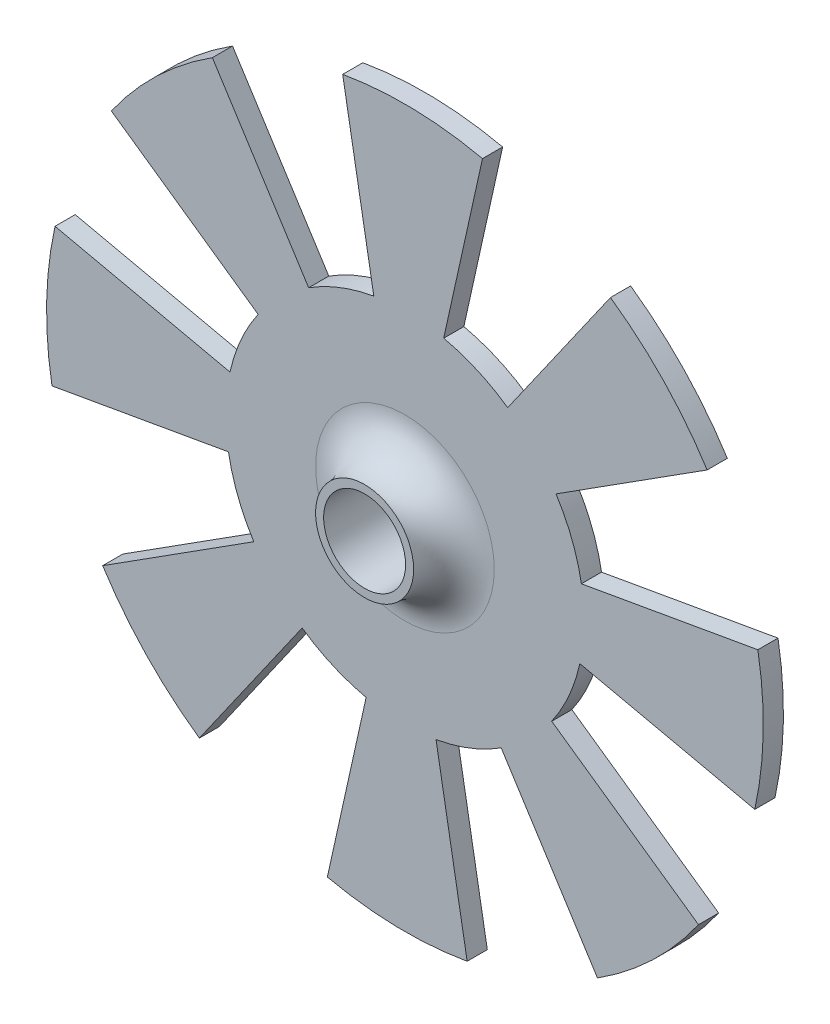
ISO-10303-21;
HEADER;
FILE_DESCRIPTION(('STEP AP214'),'2;1');
FILE_NAME('part.step','',(''),(''),'','','');
FILE_SCHEMA(('AUTOMOTIVE_DESIGN { 1 0 10303 214 1 1 1 1 }'));
ENDSEC;
DATA;
#1=APPLICATION_CONTEXT('core data for automotive mechanical design processes');
#2=APPLICATION_PROTOCOL_DEFINITION('international standard','automotive_design',2000,#1);
#3=PRODUCT_CONTEXT('',#1,'mechanical');
#4=PRODUCT('Part','Part','',(#3));
#5=PRODUCT_RELATED_PRODUCT_CATEGORY('part','',(#4));
#6=PRODUCT_DEFINITION_FORMATION('','',#4);
#7=PRODUCT_DEFINITION_CONTEXT('part definition',#1,'design');
#8=PRODUCT_DEFINITION('design','',#6,#7);
#9=PRODUCT_DEFINITION_SHAPE('','',#8);
#10=(LENGTH_UNIT() NAMED_UNIT(*) SI_UNIT(.MILLI.,.METRE.));
#11=(NAMED_UNIT(*) PLANE_ANGLE_UNIT() SI_UNIT($,.RADIAN.));
#12=(NAMED_UNIT(*) SI_UNIT($,.STERADIAN.) SOLID_ANGLE_UNIT());
#13=UNCERTAINTY_MEASURE_WITH_UNIT(LENGTH_MEASURE(1.E-05),#10,'distance_accuracy_value','');
#14=(GEOMETRIC_REPRESENTATION_CONTEXT(3) GLOBAL_UNCERTAINTY_ASSIGNED_CONTEXT((#13)) GLOBAL_UNIT_ASSIGNED_CONTEXT((#10,
#11,#12)) REPRESENTATION_CONTEXT('',''));
#15=CARTESIAN_POINT('',(0.,0.,0.));
#16=DIRECTION('',(0.,0.,1.));
#17=DIRECTION('',(1.,0.,0.));
#18=AXIS2_PLACEMENT_3D('',#15,#16,#17);
#19=CARTESIAN_POINT('',(0.,0.,0.));
#20=DIRECTION('',(0.,0.,1.));
#21=DIRECTION('',(1.,0.,0.));
#22=AXIS2_PLACEMENT_3D('',#19,#20,#21);
#23=PLANE('',#22);
#24=CARTESIAN_POINT('',(0.,0.,0.));
#25=DIRECTION('',(0.,0.,1.));
#26=DIRECTION('',(1.,0.,0.));
#27=AXIS2_PLACEMENT_3D('',#24,#25,#26);
#28=CIRCLE('',#27,2.216);
#29=CARTESIAN_POINT('',(2.216,0.,0.));
#30=VERTEX_POINT('',#29);
#31=EDGE_CURVE('E12',#30,#30,#28,.F.);
#32=ORIENTED_EDGE('',*,*,#31,.T.);
#33=EDGE_LOOP('',(#32));
#34=FACE_BOUND('',#33,.T.);
#35=CARTESIAN_POINT('',(0.,0.,0.));
#36=DIRECTION('',(0.,0.,1.));
#37=DIRECTION('',(1.,0.,0.));
#38=AXIS2_PLACEMENT_3D('',#35,#36,#37);
#39=CIRCLE('',#38,4.445);
#40=CARTESIAN_POINT('',(0.771866149729554,-4.37747046213926,0.));
#41=VERTEX_POINT('',#40);
#42=CARTESIAN_POINT('',(2.38829675910162,-3.74887497663828,0.));
#43=VERTEX_POINT('',#42);
#44=EDGE_CURVE('E146',#41,#43,#39,.T.);
#45=ORIENTED_EDGE('',*,*,#44,.T.);
#46=DIRECTION('',(0.537299608346821,-0.843391445812887,0.));
#47=VECTOR('',#46,1.);
#48=CARTESIAN_POINT('',(0.,0.,0.));
#49=LINE('',#48,#47);
#50=CARTESIAN_POINT('',(4.77659351820324,-7.49774995327657,0.));
#51=VERTEX_POINT('',#50);
#52=EDGE_CURVE('E413',#43,#51,#49,.T.);
#53=ORIENTED_EDGE('',*,*,#52,.T.);
#54=CARTESIAN_POINT('',(0.,0.,0.));
#55=DIRECTION('',(0.,0.,1.));
#56=DIRECTION('',(1.,0.,0.));
#57=AXIS2_PLACEMENT_3D('',#54,#55,#56);
#58=CIRCLE('',#57,8.89);
#59=CARTESIAN_POINT('',(7.28226167372914,-5.09909451916079,0.));
#60=VERTEX_POINT('',#59);
#61=EDGE_CURVE('E583',#51,#60,#58,.T.);
#62=ORIENTED_EDGE('',*,*,#61,.T.);
#63=DIRECTION('',(0.819152044288993,-0.573576436351044,0.));
#64=VECTOR('',#63,1.);
#65=CARTESIAN_POINT('',(0.,0.,0.));
#66=LINE('',#65,#64);
#67=CARTESIAN_POINT('',(3.64113083686457,-2.5495472595804,0.));
#68=VERTEX_POINT('',#67);
#69=EDGE_CURVE('E494',#68,#60,#66,.T.);
#70=ORIENTED_EDGE('',*,*,#69,.F.);
#71=CARTESIAN_POINT('',(0.,0.,0.));
#72=DIRECTION('',(0.,0.,1.));
#73=DIRECTION('',(1.,0.,0.));
#74=AXIS2_PLACEMENT_3D('',#71,#72,#73);
#75=CIRCLE('',#74,4.445);
#76=CARTESIAN_POINT('',(4.3396357516481,-0.962074083954887,0.));
#77=VERTEX_POINT('',#76);
#78=EDGE_CURVE('E427',#68,#77,#75,.T.);
#79=ORIENTED_EDGE('',*,*,#78,.T.);
#80=DIRECTION('',(0.976296007119932,-0.216439613938107,0.));
#81=VECTOR('',#80,1.);
#82=CARTESIAN_POINT('',(0.,0.,0.));
#83=LINE('',#82,#81);
#84=CARTESIAN_POINT('',(8.6792715032962,-1.92414816790977,0.));
#85=VERTEX_POINT('',#84);
#86=EDGE_CURVE('E486',#77,#85,#83,.T.);
#87=ORIENTED_EDGE('',*,*,#86,.T.);
#88=CARTESIAN_POINT('',(8.75494092427854,1.54373229945897,0.));
#89=VERTEX_POINT('',#88);
#90=EDGE_CURVE('E579',#85,#89,#58,.T.);
#91=ORIENTED_EDGE('',*,*,#90,.T.);
#92=DIRECTION('',(0.984807753012208,0.173648177666931,0.));
#93=VECTOR('',#92,1.);
#94=CARTESIAN_POINT('',(0.,0.,0.));
#95=LINE('',#94,#93);
#96=CARTESIAN_POINT('',(4.37747046213927,0.771866149729464,0.));
#97=VERTEX_POINT('',#96);
#98=EDGE_CURVE('E467',#97,#89,#95,.T.);
#99=ORIENTED_EDGE('',*,*,#98,.F.);
#100=CARTESIAN_POINT('',(0.,0.,0.));
#101=DIRECTION('',(0.,0.,1.));
#102=DIRECTION('',(1.,0.,0.));
#103=AXIS2_PLACEMENT_3D('',#100,#101,#102);
#104=CIRCLE('',#103,4.445);
#105=CARTESIAN_POINT('',(3.74887497663828,2.38829675910162,0.));
#106=VERTEX_POINT('',#105);
#107=EDGE_CURVE('E464',#97,#106,#104,.T.);
#108=ORIENTED_EDGE('',*,*,#107,.T.);
#109=DIRECTION('',(0.843391445812887,0.537299608346822,0.));
#110=VECTOR('',#109,1.);
#111=CARTESIAN_POINT('',(0.,0.,0.));
#112=LINE('',#111,#110);
#113=CARTESIAN_POINT('',(7.49774995327657,4.77659351820324,0.));
#114=VERTEX_POINT('',#113);
#115=EDGE_CURVE('E458',#106,#114,#112,.T.);
#116=ORIENTED_EDGE('',*,*,#115,.T.);
#117=CARTESIAN_POINT('',(5.0990945191608,7.28226167372914,0.));
#118=VERTEX_POINT('',#117);
#119=EDGE_CURVE('E575',#114,#118,#58,.T.);
#120=ORIENTED_EDGE('',*,*,#119,.T.);
#121=DIRECTION('',(0.573576436351044,0.819152044288993,0.));
#122=VECTOR('',#121,1.);
#123=CARTESIAN_POINT('',(0.,0.,0.));
#124=LINE('',#123,#122);
#125=CARTESIAN_POINT('',(2.54954725958041,3.64113083686456,0.));
#126=VERTEX_POINT('',#125);
#127=EDGE_CURVE('E518',#126,#118,#124,.T.);
#128=ORIENTED_EDGE('',*,*,#127,.F.);
#129=CARTESIAN_POINT('',(0.,0.,0.));
#130=DIRECTION('',(0.,0.,1.));
#131=DIRECTION('',(1.,0.,0.));
#132=AXIS2_PLACEMENT_3D('',#129,#130,#131);
#133=CIRCLE('',#132,4.445);
#134=CARTESIAN_POINT('',(0.962074083954882,4.3396357516481,0.));
#135=VERTEX_POINT('',#134);
#136=EDGE_CURVE('E475',#126,#135,#133,.T.);
#137=ORIENTED_EDGE('',*,*,#136,.T.);
#138=DIRECTION('',(0.216439613938106,0.976296007119933,0.));
#139=VECTOR('',#138,1.);
#140=CARTESIAN_POINT('',(0.,0.,0.));
#141=LINE('',#140,#139);
#142=CARTESIAN_POINT('',(1.92414816790976,8.6792715032962,0.));
#143=VERTEX_POINT('',#142);
#144=EDGE_CURVE('E510',#135,#143,#141,.T.);
#145=ORIENTED_EDGE('',*,*,#144,.T.);
#146=CARTESIAN_POINT('',(-1.54373229945906,8.75494092427852,0.));
#147=VERTEX_POINT('',#146);
#148=EDGE_CURVE('E562',#143,#147,#58,.T.);
#149=ORIENTED_EDGE('',*,*,#148,.T.);
#150=DIRECTION('',(-0.173648177666931,0.984807753012208,0.));
#151=VECTOR('',#150,1.);
#152=CARTESIAN_POINT('',(0.,0.,0.));
#153=LINE('',#152,#151);
#154=CARTESIAN_POINT('',(-0.771866149729548,4.37747046213926,0.));
#155=VERTEX_POINT('',#154);
#156=EDGE_CURVE('E544',#155,#147,#153,.T.);
#157=ORIENTED_EDGE('',*,*,#156,.F.);
#158=CARTESIAN_POINT('',(0.,0.,0.));
#159=DIRECTION('',(0.,0.,1.));
#160=DIRECTION('',(1.,0.,0.));
#161=AXIS2_PLACEMENT_3D('',#158,#159,#160);
#162=CIRCLE('',#161,4.445);
#163=CARTESIAN_POINT('',(-2.38829675910162,3.74887497663828,0.));
#164=VERTEX_POINT('',#163);
#165=EDGE_CURVE('E525',#155,#164,#162,.T.);
#166=ORIENTED_EDGE('',*,*,#165,.T.);
#167=DIRECTION('',(-0.537299608346821,0.843391445812887,0.));
#168=VECTOR('',#167,1.);
#169=CARTESIAN_POINT('',(0.,0.,0.));
#170=LINE('',#169,#168);
#171=CARTESIAN_POINT('',(-4.77659351820324,7.49774995327657,0.));
#172=VERTEX_POINT('',#171);
#173=EDGE_CURVE('E536',#164,#172,#170,.T.);
#174=ORIENTED_EDGE('',*,*,#173,.T.);
#175=CARTESIAN_POINT('',(-7.28226167372913,5.09909451916081,0.));
#176=VERTEX_POINT('',#175);
#177=EDGE_CURVE('E566',#172,#176,#58,.T.);
#178=ORIENTED_EDGE('',*,*,#177,.T.);
#179=DIRECTION('',(-0.819152044288993,0.573576436351044,0.));
#180=VECTOR('',#179,1.);
#181=CARTESIAN_POINT('',(0.,0.,0.));
#182=LINE('',#181,#180);
#183=CARTESIAN_POINT('',(-3.64113083686456,2.54954725958042,0.));
#184=VERTEX_POINT('',#183);
#185=EDGE_CURVE('E397',#184,#176,#182,.T.);
#186=ORIENTED_EDGE('',*,*,#185,.F.);
#187=CARTESIAN_POINT('',(0.,0.,0.));
#188=DIRECTION('',(0.,0.,1.));
#189=DIRECTION('',(1.,0.,0.));
#190=AXIS2_PLACEMENT_3D('',#187,#188,#189);
#191=CIRCLE('',#190,4.445);
#192=CARTESIAN_POINT('',(-4.3396357516481,0.962074083954881,0.));
#193=VERTEX_POINT('',#192);
#194=EDGE_CURVE('E394',#184,#193,#191,.T.);
#195=ORIENTED_EDGE('',*,*,#194,.T.);
#196=DIRECTION('',(-0.976296007119933,0.216439613938106,0.));
#197=VECTOR('',#196,1.);
#198=CARTESIAN_POINT('',(0.,0.,0.));
#199=LINE('',#198,#197);
#200=CARTESIAN_POINT('',(-8.6792715032962,1.92414816790976,0.));
#201=VERTEX_POINT('',#200);
#202=EDGE_CURVE('E388',#193,#201,#199,.T.);
#203=ORIENTED_EDGE('',*,*,#202,.T.);
#204=CARTESIAN_POINT('',(-8.75494092427853,-1.54373229945898,0.));
#205=VERTEX_POINT('',#204);
#206=EDGE_CURVE('E568',#201,#205,#58,.T.);
#207=ORIENTED_EDGE('',*,*,#206,.T.);
#208=DIRECTION('',(-0.984807753012208,-0.173648177666931,0.));
#209=VECTOR('',#208,1.);
#210=CARTESIAN_POINT('',(0.,0.,0.));
#211=LINE('',#210,#209);
#212=CARTESIAN_POINT('',(-4.37747046213927,-0.771866149729471,0.));
#213=VERTEX_POINT('',#212);
#214=EDGE_CURVE('E370',#213,#205,#211,.T.);
#215=ORIENTED_EDGE('',*,*,#214,.F.);
#216=CARTESIAN_POINT('',(0.,0.,0.));
#217=DIRECTION('',(0.,0.,1.));
#218=DIRECTION('',(1.,0.,0.));
#219=AXIS2_PLACEMENT_3D('',#216,#217,#218);
#220=CIRCLE('',#219,4.445);
#221=CARTESIAN_POINT('',(-3.74887497663828,-2.38829675910162,0.));
#222=VERTEX_POINT('',#221);
#223=EDGE_CURVE('E349',#213,#222,#220,.T.);
#224=ORIENTED_EDGE('',*,*,#223,.T.);
#225=DIRECTION('',(-0.843391445812887,-0.537299608346821,0.));
#226=VECTOR('',#225,1.);
#227=CARTESIAN_POINT('',(0.,0.,0.));
#228=LINE('',#227,#226);
#229=CARTESIAN_POINT('',(-7.49774995327657,-4.77659351820324,0.));
#230=VERTEX_POINT('',#229);
#231=EDGE_CURVE('E367',#222,#230,#228,.T.);
#232=ORIENTED_EDGE('',*,*,#231,.T.);
#233=CARTESIAN_POINT('',(-5.09909451916079,-7.28226167372914,0.));
#234=VERTEX_POINT('',#233);
#235=EDGE_CURVE('E574',#230,#234,#58,.T.);
#236=ORIENTED_EDGE('',*,*,#235,.T.);
#237=DIRECTION('',(-0.573576436351044,-0.819152044288993,0.));
#238=VECTOR('',#237,1.);
#239=CARTESIAN_POINT('',(0.,0.,0.));
#240=LINE('',#239,#238);
#241=CARTESIAN_POINT('',(-2.5495472595804,-3.64113083686457,0.));
#242=VERTEX_POINT('',#241);
#243=EDGE_CURVE('E444',#242,#234,#240,.T.);
#244=ORIENTED_EDGE('',*,*,#243,.F.);
#245=CARTESIAN_POINT('',(0.,0.,0.));
#246=DIRECTION('',(0.,0.,1.));
#247=DIRECTION('',(1.,0.,0.));
#248=AXIS2_PLACEMENT_3D('',#245,#246,#247);
#249=CIRCLE('',#248,4.445);
#250=CARTESIAN_POINT('',(-0.962074083954881,-4.3396357516481,0.));
#251=VERTEX_POINT('',#250);
#252=EDGE_CURVE('E154',#242,#251,#249,.T.);
#253=ORIENTED_EDGE('',*,*,#252,.T.);
#254=DIRECTION('',(-0.216439613938106,-0.976296007119933,0.));
#255=VECTOR('',#254,1.);
#256=CARTESIAN_POINT('',(0.,0.,0.));
#257=LINE('',#256,#255);
#258=CARTESIAN_POINT('',(-1.92414816790976,-8.6792715032962,0.));
#259=VERTEX_POINT('',#258);
#260=EDGE_CURVE('E437',#251,#259,#257,.T.);
#261=ORIENTED_EDGE('',*,*,#260,.T.);
#262=CARTESIAN_POINT('',(1.54373229945906,-8.75494092427852,0.));
#263=VERTEX_POINT('',#262);
#264=EDGE_CURVE('E587',#259,#263,#58,.T.);
#265=ORIENTED_EDGE('',*,*,#264,.T.);
#266=DIRECTION('',(0.173648177666931,-0.984807753012208,0.));
#267=VECTOR('',#266,1.);
#268=CARTESIAN_POINT('',(0.,0.,0.));
#269=LINE('',#268,#267);
#270=EDGE_CURVE('E420',#41,#263,#269,.T.);
#271=ORIENTED_EDGE('',*,*,#270,.F.);
#272=EDGE_LOOP('',(#45,#53,#62,#70,#79,#87,#91,#99,#108,#116,#120,#128,#137,#145,#149,#157,#166,
#174,#178,#186,#195,#203,#207,#215,#224,#232,#236,#244,#253,#261,#265,#271));
#273=FACE_BOUND('',#272,.T.);
#274=ADVANCED_FACE('F131',(#34,#273),#23,.T.);
#275=CARTESIAN_POINT('',(0.,0.,-0.5));
#276=DIRECTION('',(0.,0.,1.));
#277=DIRECTION('',(1.,0.,0.));
#278=AXIS2_PLACEMENT_3D('',#275,#276,#277);
#279=CYLINDRICAL_SURFACE('',#278,8.89);
#280=ORIENTED_EDGE('',*,*,#61,.F.);
#281=DIRECTION('',(0.,0.,1.));
#282=VECTOR('',#281,1.);
#283=CARTESIAN_POINT('',(4.77659351820324,-7.49774995327657,-0.5));
#284=LINE('',#283,#282);
#285=CARTESIAN_POINT('',(4.77659351820324,-7.49774995327657,-0.5));
#286=VERTEX_POINT('',#285);
#287=EDGE_CURVE('E428',#286,#51,#284,.T.);
#288=ORIENTED_EDGE('',*,*,#287,.F.);
#289=CARTESIAN_POINT('',(0.,0.,-0.5));
#290=DIRECTION('',(0.,0.,1.));
#291=DIRECTION('',(1.,0.,0.));
#292=AXIS2_PLACEMENT_3D('',#289,#290,#291);
#293=CIRCLE('',#292,8.89);
#294=CARTESIAN_POINT('',(7.28226167372914,-5.09909451916079,-0.5));
#295=VERTEX_POINT('',#294);
#296=EDGE_CURVE('E629',#286,#295,#293,.T.);
#297=ORIENTED_EDGE('',*,*,#296,.T.);
#298=DIRECTION('',(0.,0.,1.));
#299=VECTOR('',#298,1.);
#300=CARTESIAN_POINT('',(7.28226167372914,-5.09909451916079,-0.5));
#301=LINE('',#300,#299);
#302=EDGE_CURVE('E502',#295,#60,#301,.T.);
#303=ORIENTED_EDGE('',*,*,#302,.T.);
#304=EDGE_LOOP('',(#280,#288,#297,#303));
#305=FACE_BOUND('',#304,.T.);
#306=ADVANCED_FACE('F627',(#305),#279,.T.);
#307=DIRECTION('',(0.,0.,1.));
#308=VECTOR('',#307,1.);
#309=CARTESIAN_POINT('',(1.54373229945906,-8.75494092427852,-0.5));
#310=LINE('',#309,#308);
#311=CARTESIAN_POINT('',(1.54373229945906,-8.75494092427852,-0.5));
#312=VERTEX_POINT('',#311);
#313=EDGE_CURVE('E430',#312,#263,#310,.T.);
#314=ORIENTED_EDGE('',*,*,#313,.T.);
#315=ORIENTED_EDGE('',*,*,#264,.F.);
#316=DIRECTION('',(0.,0.,1.));
#317=VECTOR('',#316,1.);
#318=CARTESIAN_POINT('',(-1.92414816790976,-8.6792715032962,-0.5));
#319=LINE('',#318,#317);
#320=CARTESIAN_POINT('',(-1.92414816790976,-8.6792715032962,-0.5));
#321=VERTEX_POINT('',#320);
#322=EDGE_CURVE('E449',#321,#259,#319,.T.);
#323=ORIENTED_EDGE('',*,*,#322,.F.);
#324=EDGE_CURVE('E615',#321,#312,#293,.T.);
#325=ORIENTED_EDGE('',*,*,#324,.T.);
#326=EDGE_LOOP('',(#314,#315,#323,#325));
#327=FACE_BOUND('',#326,.T.);
#328=ADVANCED_FACE('F613',(#327),#279,.T.);
#329=DIRECTION('',(0.,0.,1.));
#330=VECTOR('',#329,1.);
#331=CARTESIAN_POINT('',(-5.09909451916079,-7.28226167372914,-0.5));
#332=LINE('',#331,#330);
#333=CARTESIAN_POINT('',(-5.09909451916079,-7.28226167372914,-0.5));
#334=VERTEX_POINT('',#333);
#335=EDGE_CURVE('E451',#334,#234,#332,.T.);
#336=ORIENTED_EDGE('',*,*,#335,.T.);
#337=ORIENTED_EDGE('',*,*,#235,.F.);
#338=DIRECTION('',(0.,0.,1.));
#339=VECTOR('',#338,1.);
#340=CARTESIAN_POINT('',(-7.49774995327657,-4.77659351820324,-0.5));
#341=LINE('',#340,#339);
#342=CARTESIAN_POINT('',(-7.49774995327657,-4.77659351820324,-0.5));
#343=VERTEX_POINT('',#342);
#344=EDGE_CURVE('E382',#343,#230,#341,.T.);
#345=ORIENTED_EDGE('',*,*,#344,.F.);
#346=EDGE_CURVE('E600',#343,#334,#293,.T.);
#347=ORIENTED_EDGE('',*,*,#346,.T.);
#348=EDGE_LOOP('',(#336,#337,#345,#347));
#349=FACE_BOUND('',#348,.T.);
#350=ADVANCED_FACE('F598',(#349),#279,.T.);
#351=DIRECTION('',(0.,0.,1.));
#352=VECTOR('',#351,1.);
#353=CARTESIAN_POINT('',(-8.75494092427853,-1.54373229945898,-0.5));
#354=LINE('',#353,#352);
#355=CARTESIAN_POINT('',(-8.75494092427853,-1.54373229945898,-0.5));
#356=VERTEX_POINT('',#355);
#357=EDGE_CURVE('E352',#356,#205,#354,.T.);
#358=ORIENTED_EDGE('',*,*,#357,.T.);
#359=ORIENTED_EDGE('',*,*,#206,.F.);
#360=DIRECTION('',(0.,0.,1.));
#361=VECTOR('',#360,1.);
#362=CARTESIAN_POINT('',(-8.6792715032962,1.92414816790976,-0.5));
#363=LINE('',#362,#361);
#364=CARTESIAN_POINT('',(-8.6792715032962,1.92414816790976,-0.5));
#365=VERTEX_POINT('',#364);
#366=EDGE_CURVE('E403',#365,#201,#363,.T.);
#367=ORIENTED_EDGE('',*,*,#366,.F.);
#368=EDGE_CURVE('E564',#365,#356,#293,.T.);
#369=ORIENTED_EDGE('',*,*,#368,.T.);
#370=EDGE_LOOP('',(#358,#359,#367,#369));
#371=FACE_BOUND('',#370,.T.);
#372=ADVANCED_FACE('F703',(#371),#279,.T.);
#373=ORIENTED_EDGE('',*,*,#148,.F.);
#374=DIRECTION('',(0.,0.,1.));
#375=VECTOR('',#374,1.);
#376=CARTESIAN_POINT('',(1.92414816790976,8.6792715032962,-0.5));
#377=LINE('',#376,#375);
#378=CARTESIAN_POINT('',(1.92414816790976,8.6792715032962,-0.5));
#379=VERTEX_POINT('',#378);
#380=EDGE_CURVE('E526',#379,#143,#377,.T.);
#381=ORIENTED_EDGE('',*,*,#380,.F.);
#382=CARTESIAN_POINT('',(-1.54373229945906,8.75494092427852,-0.5));
#383=VERTEX_POINT('',#382);
#384=EDGE_CURVE('E565',#379,#383,#293,.T.);
#385=ORIENTED_EDGE('',*,*,#384,.T.);
#386=DIRECTION('',(0.,0.,1.));
#387=VECTOR('',#386,1.);
#388=CARTESIAN_POINT('',(-1.54373229945906,8.75494092427852,-0.5));
#389=LINE('',#388,#387);
#390=EDGE_CURVE('E555',#383,#147,#389,.T.);
#391=ORIENTED_EDGE('',*,*,#390,.T.);
#392=EDGE_LOOP('',(#373,#381,#385,#391));
#393=FACE_BOUND('',#392,.T.);
#394=ADVANCED_FACE('F674',(#393),#279,.T.);
#395=DIRECTION('',(0.,0.,1.));
#396=VECTOR('',#395,1.);
#397=CARTESIAN_POINT('',(5.0990945191608,7.28226167372914,-0.5));
#398=LINE('',#397,#396);
#399=CARTESIAN_POINT('',(5.0990945191608,7.28226167372914,-0.5));
#400=VERTEX_POINT('',#399);
#401=EDGE_CURVE('E528',#400,#118,#398,.T.);
#402=ORIENTED_EDGE('',*,*,#401,.T.);
#403=ORIENTED_EDGE('',*,*,#119,.F.);
#404=DIRECTION('',(0.,0.,1.));
#405=VECTOR('',#404,1.);
#406=CARTESIAN_POINT('',(7.49774995327657,4.77659351820324,-0.5));
#407=LINE('',#406,#405);
#408=CARTESIAN_POINT('',(7.49774995327657,4.77659351820324,-0.5));
#409=VERTEX_POINT('',#408);
#410=EDGE_CURVE('E476',#409,#114,#407,.T.);
#411=ORIENTED_EDGE('',*,*,#410,.F.);
#412=EDGE_CURVE('E572',#409,#400,#293,.T.);
#413=ORIENTED_EDGE('',*,*,#412,.T.);
#414=EDGE_LOOP('',(#402,#403,#411,#413));
#415=FACE_BOUND('',#414,.T.);
#416=ADVANCED_FACE('F659',(#415),#279,.T.);
#417=DIRECTION('',(0.,0.,1.));
#418=VECTOR('',#417,1.);
#419=CARTESIAN_POINT('',(8.75494092427854,1.54373229945897,-0.5));
#420=LINE('',#419,#418);
#421=CARTESIAN_POINT('',(8.75494092427854,1.54373229945897,-0.5));
#422=VERTEX_POINT('',#421);
#423=EDGE_CURVE('E478',#422,#89,#420,.T.);
#424=ORIENTED_EDGE('',*,*,#423,.T.);
#425=ORIENTED_EDGE('',*,*,#90,.F.);
#426=DIRECTION('',(0.,0.,1.));
#427=VECTOR('',#426,1.);
#428=CARTESIAN_POINT('',(8.6792715032962,-1.92414816790977,-0.5));
#429=LINE('',#428,#427);
#430=CARTESIAN_POINT('',(8.6792715032962,-1.92414816790977,-0.5));
#431=VERTEX_POINT('',#430);
#432=EDGE_CURVE('E500',#431,#85,#429,.T.);
#433=ORIENTED_EDGE('',*,*,#432,.F.);
#434=EDGE_CURVE('E645',#431,#422,#293,.T.);
#435=ORIENTED_EDGE('',*,*,#434,.T.);
#436=EDGE_LOOP('',(#424,#425,#433,#435));
#437=FACE_BOUND('',#436,.T.);
#438=ADVANCED_FACE('F643',(#437),#279,.T.);
#439=CARTESIAN_POINT('',(0.,0.,-0.5));
#440=DIRECTION('',(0.,0.,1.));
#441=DIRECTION('',(1.,0.,0.));
#442=AXIS2_PLACEMENT_3D('',#439,#440,#441);
#443=PLANE('',#442);
#444=CARTESIAN_POINT('',(0.,0.,-0.5));
#445=DIRECTION('',(0.,0.,1.));
#446=DIRECTION('',(1.,0.,0.));
#447=AXIS2_PLACEMENT_3D('',#444,#445,#446);
#448=CIRCLE('',#447,1.016);
#449=CARTESIAN_POINT('',(1.016,0.,-0.5));
#450=VERTEX_POINT('',#449);
#451=EDGE_CURVE('E552',#450,#450,#448,.T.);
#452=ORIENTED_EDGE('',*,*,#451,.T.);
#453=EDGE_LOOP('',(#452));
#454=FACE_BOUND('',#453,.T.);
#455=DIRECTION('',(0.537299608346821,-0.843391445812887,0.));
#456=VECTOR('',#455,1.);
#457=CARTESIAN_POINT('',(0.,0.,-0.5));
#458=LINE('',#457,#456);
#459=CARTESIAN_POINT('',(2.38829675910162,-3.74887497663828,-0.5));
#460=VERTEX_POINT('',#459);
#461=EDGE_CURVE('E416',#460,#286,#458,.T.);
#462=ORIENTED_EDGE('',*,*,#461,.F.);
#463=CARTESIAN_POINT('',(0.,0.,-0.5));
#464=DIRECTION('',(0.,0.,1.));
#465=DIRECTION('',(1.,0.,0.));
#466=AXIS2_PLACEMENT_3D('',#463,#464,#465);
#467=CIRCLE('',#466,4.445);
#468=CARTESIAN_POINT('',(0.771866149729554,-4.37747046213926,-0.5));
#469=VERTEX_POINT('',#468);
#470=EDGE_CURVE('E410',#469,#460,#467,.T.);
#471=ORIENTED_EDGE('',*,*,#470,.F.);
#472=DIRECTION('',(0.173648177666931,-0.984807753012208,0.));
#473=VECTOR('',#472,1.);
#474=CARTESIAN_POINT('',(0.,0.,-0.5));
#475=LINE('',#474,#473);
#476=EDGE_CURVE('E412',#469,#312,#475,.T.);
#477=ORIENTED_EDGE('',*,*,#476,.T.);
#478=ORIENTED_EDGE('',*,*,#324,.F.);
#479=DIRECTION('',(-0.216439613938106,-0.976296007119933,0.));
#480=VECTOR('',#479,1.);
#481=CARTESIAN_POINT('',(0.,0.,-0.5));
#482=LINE('',#481,#480);
#483=CARTESIAN_POINT('',(-0.962074083954881,-4.3396357516481,-0.5));
#484=VERTEX_POINT('',#483);
#485=EDGE_CURVE('E440',#484,#321,#482,.T.);
#486=ORIENTED_EDGE('',*,*,#485,.F.);
#487=CARTESIAN_POINT('',(0.,0.,-0.5));
#488=DIRECTION('',(0.,0.,1.));
#489=DIRECTION('',(1.,0.,0.));
#490=AXIS2_PLACEMENT_3D('',#487,#488,#489);
#491=CIRCLE('',#490,4.445);
#492=CARTESIAN_POINT('',(-2.5495472595804,-3.64113083686457,-0.5));
#493=VERTEX_POINT('',#492);
#494=EDGE_CURVE('E434',#493,#484,#491,.T.);
#495=ORIENTED_EDGE('',*,*,#494,.F.);
#496=DIRECTION('',(-0.573576436351044,-0.819152044288993,0.));
#497=VECTOR('',#496,1.);
#498=CARTESIAN_POINT('',(0.,0.,-0.5));
#499=LINE('',#498,#497);
#500=EDGE_CURVE('E436',#493,#334,#499,.T.);
#501=ORIENTED_EDGE('',*,*,#500,.T.);
#502=ORIENTED_EDGE('',*,*,#346,.F.);
#503=DIRECTION('',(-0.843391445812887,-0.537299608346821,0.));
#504=VECTOR('',#503,1.);
#505=CARTESIAN_POINT('',(0.,0.,-0.5));
#506=LINE('',#505,#504);
#507=CARTESIAN_POINT('',(-3.74887497663828,-2.38829675910162,-0.5));
#508=VERTEX_POINT('',#507);
#509=EDGE_CURVE('E353',#508,#343,#506,.T.);
#510=ORIENTED_EDGE('',*,*,#509,.F.);
#511=CARTESIAN_POINT('',(0.,0.,-0.5));
#512=DIRECTION('',(0.,0.,1.));
#513=DIRECTION('',(1.,0.,0.));
#514=AXIS2_PLACEMENT_3D('',#511,#512,#513);
#515=CIRCLE('',#514,4.445);
#516=CARTESIAN_POINT('',(-4.37747046213927,-0.771866149729471,-0.5));
#517=VERTEX_POINT('',#516);
#518=EDGE_CURVE('E346',#517,#508,#515,.T.);
#519=ORIENTED_EDGE('',*,*,#518,.F.);
#520=DIRECTION('',(-0.984807753012208,-0.173648177666931,0.));
#521=VECTOR('',#520,1.);
#522=CARTESIAN_POINT('',(0.,0.,-0.5));
#523=LINE('',#522,#521);
#524=EDGE_CURVE('E356',#517,#356,#523,.T.);
#525=ORIENTED_EDGE('',*,*,#524,.T.);
#526=ORIENTED_EDGE('',*,*,#368,.F.);
#527=DIRECTION('',(-0.976296007119933,0.216439613938106,0.));
#528=VECTOR('',#527,1.);
#529=CARTESIAN_POINT('',(0.,0.,-0.5));
#530=LINE('',#529,#528);
#531=CARTESIAN_POINT('',(-4.3396357516481,0.962074083954881,-0.5));
#532=VERTEX_POINT('',#531);
#533=EDGE_CURVE('E391',#532,#365,#530,.T.);
#534=ORIENTED_EDGE('',*,*,#533,.F.);
#535=CARTESIAN_POINT('',(0.,0.,-0.5));
#536=DIRECTION('',(0.,0.,1.));
#537=DIRECTION('',(1.,0.,0.));
#538=AXIS2_PLACEMENT_3D('',#535,#536,#537);
#539=CIRCLE('',#538,4.445);
#540=CARTESIAN_POINT('',(-3.64113083686456,2.54954725958042,-0.5));
#541=VERTEX_POINT('',#540);
#542=EDGE_CURVE('E385',#541,#532,#539,.T.);
#543=ORIENTED_EDGE('',*,*,#542,.F.);
#544=DIRECTION('',(-0.819152044288993,0.573576436351044,0.));
#545=VECTOR('',#544,1.);
#546=CARTESIAN_POINT('',(0.,0.,-0.5));
#547=LINE('',#546,#545);
#548=CARTESIAN_POINT('',(-7.28226167372913,5.09909451916081,-0.5));
#549=VERTEX_POINT('',#548);
#550=EDGE_CURVE('E387',#541,#549,#547,.T.);
#551=ORIENTED_EDGE('',*,*,#550,.T.);
#552=CARTESIAN_POINT('',(-4.77659351820324,7.49774995327657,-0.5));
#553=VERTEX_POINT('',#552);
#554=EDGE_CURVE('E139',#553,#549,#293,.T.);
#555=ORIENTED_EDGE('',*,*,#554,.F.);
#556=DIRECTION('',(-0.537299608346821,0.843391445812887,0.));
#557=VECTOR('',#556,1.);
#558=CARTESIAN_POINT('',(0.,0.,-0.5));
#559=LINE('',#558,#557);
#560=CARTESIAN_POINT('',(-2.38829675910162,3.74887497663828,-0.5));
#561=VERTEX_POINT('',#560);
#562=EDGE_CURVE('E539',#561,#553,#559,.T.);
#563=ORIENTED_EDGE('',*,*,#562,.F.);
#564=CARTESIAN_POINT('',(0.,0.,-0.5));
#565=DIRECTION('',(0.,0.,1.));
#566=DIRECTION('',(1.,0.,0.));
#567=AXIS2_PLACEMENT_3D('',#564,#565,#566);
#568=CIRCLE('',#567,4.445);
#569=CARTESIAN_POINT('',(-0.771866149729548,4.37747046213926,-0.5));
#570=VERTEX_POINT('',#569);
#571=EDGE_CURVE('E533',#570,#561,#568,.T.);
#572=ORIENTED_EDGE('',*,*,#571,.F.);
#573=DIRECTION('',(-0.173648177666931,0.984807753012208,0.));
#574=VECTOR('',#573,1.);
#575=CARTESIAN_POINT('',(0.,0.,-0.5));
#576=LINE('',#575,#574);
#577=EDGE_CURVE('E535',#570,#383,#576,.T.);
#578=ORIENTED_EDGE('',*,*,#577,.T.);
#579=ORIENTED_EDGE('',*,*,#384,.F.);
#580=DIRECTION('',(0.216439613938106,0.976296007119933,0.));
#581=VECTOR('',#580,1.);
#582=CARTESIAN_POINT('',(0.,0.,-0.5));
#583=LINE('',#582,#581);
#584=CARTESIAN_POINT('',(0.962074083954882,4.3396357516481,-0.5));
#585=VERTEX_POINT('',#584);
#586=EDGE_CURVE('E513',#585,#379,#583,.T.);
#587=ORIENTED_EDGE('',*,*,#586,.F.);
#588=CARTESIAN_POINT('',(0.,0.,-0.5));
#589=DIRECTION('',(0.,0.,1.));
#590=DIRECTION('',(1.,0.,0.));
#591=AXIS2_PLACEMENT_3D('',#588,#589,#590);
#592=CIRCLE('',#591,4.445);
#593=CARTESIAN_POINT('',(2.54954725958041,3.64113083686456,-0.5));
#594=VERTEX_POINT('',#593);
#595=EDGE_CURVE('E507',#594,#585,#592,.T.);
#596=ORIENTED_EDGE('',*,*,#595,.F.);
#597=DIRECTION('',(0.573576436351044,0.819152044288993,0.));
#598=VECTOR('',#597,1.);
#599=CARTESIAN_POINT('',(0.,0.,-0.5));
#600=LINE('',#599,#598);
#601=EDGE_CURVE('E509',#594,#400,#600,.T.);
#602=ORIENTED_EDGE('',*,*,#601,.T.);
#603=ORIENTED_EDGE('',*,*,#412,.F.);
#604=DIRECTION('',(0.843391445812887,0.537299608346822,0.));
#605=VECTOR('',#604,1.);
#606=CARTESIAN_POINT('',(0.,0.,-0.5));
#607=LINE('',#606,#605);
#608=CARTESIAN_POINT('',(3.74887497663828,2.38829675910162,-0.5));
#609=VERTEX_POINT('',#608);
#610=EDGE_CURVE('E461',#609,#409,#607,.T.);
#611=ORIENTED_EDGE('',*,*,#610,.F.);
#612=CARTESIAN_POINT('',(0.,0.,-0.5));
#613=DIRECTION('',(0.,0.,1.));
#614=DIRECTION('',(1.,0.,0.));
#615=AXIS2_PLACEMENT_3D('',#612,#613,#614);
#616=CIRCLE('',#615,4.445);
#617=CARTESIAN_POINT('',(4.37747046213927,0.771866149729464,-0.5));
#618=VERTEX_POINT('',#617);
#619=EDGE_CURVE('E455',#618,#609,#616,.T.);
#620=ORIENTED_EDGE('',*,*,#619,.F.);
#621=DIRECTION('',(0.984807753012208,0.173648177666931,0.));
#622=VECTOR('',#621,1.);
#623=CARTESIAN_POINT('',(0.,0.,-0.5));
#624=LINE('',#623,#622);
#625=EDGE_CURVE('E457',#618,#422,#624,.T.);
#626=ORIENTED_EDGE('',*,*,#625,.T.);
#627=ORIENTED_EDGE('',*,*,#434,.F.);
#628=DIRECTION('',(0.976296007119932,-0.216439613938107,0.));
#629=VECTOR('',#628,1.);
#630=CARTESIAN_POINT('',(0.,0.,-0.5));
#631=LINE('',#630,#629);
#632=CARTESIAN_POINT('',(4.3396357516481,-0.962074083954887,-0.5));
#633=VERTEX_POINT('',#632);
#634=EDGE_CURVE('E489',#633,#431,#631,.T.);
#635=ORIENTED_EDGE('',*,*,#634,.F.);
#636=CARTESIAN_POINT('',(0.,0.,-0.5));
#637=DIRECTION('',(0.,0.,1.));
#638=DIRECTION('',(1.,0.,0.));
#639=AXIS2_PLACEMENT_3D('',#636,#637,#638);
#640=CIRCLE('',#639,4.445);
#641=CARTESIAN_POINT('',(3.64113083686457,-2.5495472595804,-0.5));
#642=VERTEX_POINT('',#641);
#643=EDGE_CURVE('E483',#642,#633,#640,.T.);
#644=ORIENTED_EDGE('',*,*,#643,.F.);
#645=DIRECTION('',(0.819152044288993,-0.573576436351044,0.));
#646=VECTOR('',#645,1.);
#647=CARTESIAN_POINT('',(0.,0.,-0.5));
#648=LINE('',#647,#646);
#649=EDGE_CURVE('E485',#642,#295,#648,.T.);
#650=ORIENTED_EDGE('',*,*,#649,.T.);
#651=ORIENTED_EDGE('',*,*,#296,.F.);
#652=EDGE_LOOP('',(#462,#471,#477,#478,#486,#495,#501,#502,#510,#519,#525,#526,#534,#543,#551,
#555,#563,#572,#578,#579,#587,#596,#602,#603,#611,#620,#626,#627,#635,#644,#650,#651));
#653=FACE_BOUND('',#652,.T.);
#654=ADVANCED_FACE('F365',(#454,#653),#443,.F.);
#655=DIRECTION('',(0.,0.,1.));
#656=VECTOR('',#655,1.);
#657=CARTESIAN_POINT('',(-7.28226167372913,5.09909451916081,-0.5));
#658=LINE('',#657,#656);
#659=EDGE_CURVE('E405',#549,#176,#658,.T.);
#660=ORIENTED_EDGE('',*,*,#659,.T.);
#661=ORIENTED_EDGE('',*,*,#177,.F.);
#662=DIRECTION('',(0.,0.,1.));
#663=VECTOR('',#662,1.);
#664=CARTESIAN_POINT('',(-4.77659351820324,7.49774995327657,-0.5));
#665=LINE('',#664,#663);
#666=EDGE_CURVE('E553',#553,#172,#665,.T.);
#667=ORIENTED_EDGE('',*,*,#666,.F.);
#668=ORIENTED_EDGE('',*,*,#554,.T.);
#669=EDGE_LOOP('',(#660,#661,#667,#668));
#670=FACE_BOUND('',#669,.T.);
#671=ADVANCED_FACE('F689',(#670),#279,.T.);
#672=CARTESIAN_POINT('',(0.,0.,-0.5));
#673=DIRECTION('',(0.,0.,1.));
#674=DIRECTION('',(1.,0.,0.));
#675=AXIS2_PLACEMENT_3D('',#672,#673,#674);
#676=CYLINDRICAL_SURFACE('',#675,1.016);
#677=ORIENTED_EDGE('',*,*,#451,.F.);
#678=EDGE_LOOP('',(#677));
#679=FACE_BOUND('',#678,.T.);
#680=CARTESIAN_POINT('',(0.,0.,1.));
#681=DIRECTION('',(0.,0.,1.));
#682=DIRECTION('',(1.,0.,0.));
#683=AXIS2_PLACEMENT_3D('',#680,#681,#682);
#684=CIRCLE('',#683,1.016);
#685=CARTESIAN_POINT('',(1.016,0.,1.));
#686=VERTEX_POINT('',#685);
#687=EDGE_CURVE('E785',#686,#686,#684,.T.);
#688=ORIENTED_EDGE('',*,*,#687,.T.);
#689=EDGE_LOOP('',(#688));
#690=FACE_BOUND('',#689,.T.);
#691=ADVANCED_FACE('F719',(#679,#690),#676,.F.);
#692=CARTESIAN_POINT('',(0.,0.,-0.5));
#693=DIRECTION('',(0.,0.,1.));
#694=DIRECTION('',(1.,0.,0.));
#695=AXIS2_PLACEMENT_3D('',#692,#693,#694);
#696=CYLINDRICAL_SURFACE('',#695,4.445);
#697=ORIENTED_EDGE('',*,*,#165,.F.);
#698=DIRECTION('',(0.,0.,1.));
#699=VECTOR('',#698,1.);
#700=CARTESIAN_POINT('',(-0.771866149729548,4.37747046213926,-0.5));
#701=LINE('',#700,#699);
#702=EDGE_CURVE('E541',#570,#155,#701,.T.);
#703=ORIENTED_EDGE('',*,*,#702,.F.);
#704=ORIENTED_EDGE('',*,*,#571,.T.);
#705=DIRECTION('',(0.,0.,1.));
#706=VECTOR('',#705,1.);
#707=CARTESIAN_POINT('',(-2.38829675910162,3.74887497663828,-0.5));
#708=LINE('',#707,#706);
#709=EDGE_CURVE('E549',#561,#164,#708,.T.);
#710=ORIENTED_EDGE('',*,*,#709,.T.);
#711=EDGE_LOOP('',(#697,#703,#704,#710));
#712=FACE_BOUND('',#711,.T.);
#713=ADVANCED_FACE('F684',(#712),#696,.T.);
#714=CARTESIAN_POINT('',(0.,0.,-0.5));
#715=DIRECTION('',(0.843391445812887,0.537299608346821,0.));
#716=DIRECTION('',(-0.537299608346821,0.843391445812887,0.));
#717=AXIS2_PLACEMENT_3D('',#714,#715,#716);
#718=PLANE('',#717);
#719=ORIENTED_EDGE('',*,*,#173,.F.);
#720=ORIENTED_EDGE('',*,*,#709,.F.);
#721=ORIENTED_EDGE('',*,*,#562,.T.);
#722=ORIENTED_EDGE('',*,*,#666,.T.);
#723=EDGE_LOOP('',(#719,#720,#721,#722));
#724=FACE_BOUND('',#723,.T.);
#725=ADVANCED_FACE('F686',(#724),#718,.T.);
#726=CARTESIAN_POINT('',(0.,0.,-0.5));
#727=DIRECTION('',(0.984807753012208,0.173648177666931,0.));
#728=DIRECTION('',(-0.173648177666931,0.984807753012208,0.));
#729=AXIS2_PLACEMENT_3D('',#726,#727,#728);
#730=PLANE('',#729);
#731=ORIENTED_EDGE('',*,*,#156,.T.);
#732=ORIENTED_EDGE('',*,*,#390,.F.);
#733=ORIENTED_EDGE('',*,*,#577,.F.);
#734=ORIENTED_EDGE('',*,*,#702,.T.);
#735=EDGE_LOOP('',(#731,#732,#733,#734));
#736=FACE_BOUND('',#735,.T.);
#737=ADVANCED_FACE('F678',(#736),#730,.F.);
#738=CARTESIAN_POINT('',(0.,0.,-0.5));
#739=DIRECTION('',(0.,0.,1.));
#740=DIRECTION('',(1.,0.,0.));
#741=AXIS2_PLACEMENT_3D('',#738,#739,#740);
#742=CYLINDRICAL_SURFACE('',#741,4.445);
#743=ORIENTED_EDGE('',*,*,#78,.F.);
#744=DIRECTION('',(0.,0.,1.));
#745=VECTOR('',#744,1.);
#746=CARTESIAN_POINT('',(3.64113083686457,-2.5495472595804,-0.5));
#747=LINE('',#746,#745);
#748=EDGE_CURVE('E491',#642,#68,#747,.T.);
#749=ORIENTED_EDGE('',*,*,#748,.F.);
#750=ORIENTED_EDGE('',*,*,#643,.T.);
#751=DIRECTION('',(0.,0.,1.));
#752=VECTOR('',#751,1.);
#753=CARTESIAN_POINT('',(4.3396357516481,-0.962074083954887,-0.5));
#754=LINE('',#753,#752);
#755=EDGE_CURVE('E468',#633,#77,#754,.T.);
#756=ORIENTED_EDGE('',*,*,#755,.T.);
#757=EDGE_LOOP('',(#743,#749,#750,#756));
#758=FACE_BOUND('',#757,.T.);
#759=ADVANCED_FACE('F638',(#758),#742,.T.);
#760=CARTESIAN_POINT('',(0.,0.,-0.5));
#761=DIRECTION('',(-0.216439613938107,-0.976296007119932,0.));
#762=DIRECTION('',(0.976296007119932,-0.216439613938107,0.));
#763=AXIS2_PLACEMENT_3D('',#760,#761,#762);
#764=PLANE('',#763);
#765=ORIENTED_EDGE('',*,*,#86,.F.);
#766=ORIENTED_EDGE('',*,*,#755,.F.);
#767=ORIENTED_EDGE('',*,*,#634,.T.);
#768=ORIENTED_EDGE('',*,*,#432,.T.);
#769=EDGE_LOOP('',(#765,#766,#767,#768));
#770=FACE_BOUND('',#769,.T.);
#771=ADVANCED_FACE('F640',(#770),#764,.T.);
#772=CARTESIAN_POINT('',(0.,0.,-0.5));
#773=DIRECTION('',(-0.573576436351044,-0.819152044288993,0.));
#774=DIRECTION('',(0.819152044288993,-0.573576436351044,0.));
#775=AXIS2_PLACEMENT_3D('',#772,#773,#774);
#776=PLANE('',#775);
#777=ORIENTED_EDGE('',*,*,#69,.T.);
#778=ORIENTED_EDGE('',*,*,#302,.F.);
#779=ORIENTED_EDGE('',*,*,#649,.F.);
#780=ORIENTED_EDGE('',*,*,#748,.T.);
#781=EDGE_LOOP('',(#777,#778,#779,#780));
#782=FACE_BOUND('',#781,.T.);
#783=ADVANCED_FACE('F632',(#782),#776,.F.);
#784=CARTESIAN_POINT('',(0.,0.,-0.5));
#785=DIRECTION('',(0.,0.,1.));
#786=DIRECTION('',(1.,0.,0.));
#787=AXIS2_PLACEMENT_3D('',#784,#785,#786);
#788=CYLINDRICAL_SURFACE('',#787,4.445);
#789=ORIENTED_EDGE('',*,*,#107,.F.);
#790=DIRECTION('',(0.,0.,1.));
#791=VECTOR('',#790,1.);
#792=CARTESIAN_POINT('',(4.37747046213927,0.771866149729464,-0.5));
#793=LINE('',#792,#791);
#794=EDGE_CURVE('E463',#618,#97,#793,.T.);
#795=ORIENTED_EDGE('',*,*,#794,.F.);
#796=ORIENTED_EDGE('',*,*,#619,.T.);
#797=DIRECTION('',(0.,0.,1.));
#798=VECTOR('',#797,1.);
#799=CARTESIAN_POINT('',(3.74887497663828,2.38829675910162,-0.5));
#800=LINE('',#799,#798);
#801=EDGE_CURVE('E472',#609,#106,#800,.T.);
#802=ORIENTED_EDGE('',*,*,#801,.T.);
#803=EDGE_LOOP('',(#789,#795,#796,#802));
#804=FACE_BOUND('',#803,.T.);
#805=ADVANCED_FACE('F654',(#804),#788,.T.);
#806=CARTESIAN_POINT('',(0.,0.,-0.5));
#807=DIRECTION('',(0.537299608346821,-0.843391445812887,0.));
#808=DIRECTION('',(0.843391445812887,0.537299608346822,0.));
#809=AXIS2_PLACEMENT_3D('',#806,#807,#808);
#810=PLANE('',#809);
#811=ORIENTED_EDGE('',*,*,#115,.F.);
#812=ORIENTED_EDGE('',*,*,#801,.F.);
#813=ORIENTED_EDGE('',*,*,#610,.T.);
#814=ORIENTED_EDGE('',*,*,#410,.T.);
#815=EDGE_LOOP('',(#811,#812,#813,#814));
#816=FACE_BOUND('',#815,.T.);
#817=ADVANCED_FACE('F656',(#816),#810,.T.);
#818=CARTESIAN_POINT('',(0.,0.,-0.5));
#819=DIRECTION('',(0.173648177666931,-0.984807753012208,0.));
#820=DIRECTION('',(0.984807753012208,0.173648177666931,0.));
#821=AXIS2_PLACEMENT_3D('',#818,#819,#820);
#822=PLANE('',#821);
#823=ORIENTED_EDGE('',*,*,#98,.T.);
#824=ORIENTED_EDGE('',*,*,#423,.F.);
#825=ORIENTED_EDGE('',*,*,#625,.F.);
#826=ORIENTED_EDGE('',*,*,#794,.T.);
#827=EDGE_LOOP('',(#823,#824,#825,#826));
#828=FACE_BOUND('',#827,.T.);
#829=ADVANCED_FACE('F648',(#828),#822,.F.);
#830=CARTESIAN_POINT('',(0.,0.,-0.5));
#831=DIRECTION('',(0.,0.,1.));
#832=DIRECTION('',(1.,0.,0.));
#833=AXIS2_PLACEMENT_3D('',#830,#831,#832);
#834=CYLINDRICAL_SURFACE('',#833,4.445);
#835=ORIENTED_EDGE('',*,*,#136,.F.);
#836=DIRECTION('',(0.,0.,1.));
#837=VECTOR('',#836,1.);
#838=CARTESIAN_POINT('',(2.54954725958041,3.64113083686456,-0.5));
#839=LINE('',#838,#837);
#840=EDGE_CURVE('E515',#594,#126,#839,.T.);
#841=ORIENTED_EDGE('',*,*,#840,.F.);
#842=ORIENTED_EDGE('',*,*,#595,.T.);
#843=DIRECTION('',(0.,0.,1.));
#844=VECTOR('',#843,1.);
#845=CARTESIAN_POINT('',(0.962074083954882,4.3396357516481,-0.5));
#846=LINE('',#845,#844);
#847=EDGE_CURVE('E522',#585,#135,#846,.T.);
#848=ORIENTED_EDGE('',*,*,#847,.T.);
#849=EDGE_LOOP('',(#835,#841,#842,#848));
#850=FACE_BOUND('',#849,.T.);
#851=ADVANCED_FACE('F669',(#850),#834,.T.);
#852=CARTESIAN_POINT('',(0.,0.,-0.5));
#853=DIRECTION('',(0.976296007119933,-0.216439613938106,0.));
#854=DIRECTION('',(0.216439613938106,0.976296007119933,0.));
#855=AXIS2_PLACEMENT_3D('',#852,#853,#854);
#856=PLANE('',#855);
#857=ORIENTED_EDGE('',*,*,#144,.F.);
#858=ORIENTED_EDGE('',*,*,#847,.F.);
#859=ORIENTED_EDGE('',*,*,#586,.T.);
#860=ORIENTED_EDGE('',*,*,#380,.T.);
#861=EDGE_LOOP('',(#857,#858,#859,#860));
#862=FACE_BOUND('',#861,.T.);
#863=ADVANCED_FACE('F671',(#862),#856,.T.);
#864=CARTESIAN_POINT('',(0.,0.,-0.5));
#865=DIRECTION('',(0.819152044288993,-0.573576436351044,0.));
#866=DIRECTION('',(0.573576436351044,0.819152044288993,0.));
#867=AXIS2_PLACEMENT_3D('',#864,#865,#866);
#868=PLANE('',#867);
#869=ORIENTED_EDGE('',*,*,#127,.T.);
#870=ORIENTED_EDGE('',*,*,#401,.F.);
#871=ORIENTED_EDGE('',*,*,#601,.F.);
#872=ORIENTED_EDGE('',*,*,#840,.T.);
#873=EDGE_LOOP('',(#869,#870,#871,#872));
#874=FACE_BOUND('',#873,.T.);
#875=ADVANCED_FACE('F663',(#874),#868,.F.);
#876=CARTESIAN_POINT('',(0.,0.,-0.5));
#877=DIRECTION('',(0.,0.,1.));
#878=DIRECTION('',(1.,0.,0.));
#879=AXIS2_PLACEMENT_3D('',#876,#877,#878);
#880=CYLINDRICAL_SURFACE('',#879,4.445);
#881=ORIENTED_EDGE('',*,*,#194,.F.);
#882=DIRECTION('',(0.,0.,1.));
#883=VECTOR('',#882,1.);
#884=CARTESIAN_POINT('',(-3.64113083686456,2.54954725958042,-0.5));
#885=LINE('',#884,#883);
#886=EDGE_CURVE('E393',#541,#184,#885,.T.);
#887=ORIENTED_EDGE('',*,*,#886,.F.);
#888=ORIENTED_EDGE('',*,*,#542,.T.);
#889=DIRECTION('',(0.,0.,1.));
#890=VECTOR('',#889,1.);
#891=CARTESIAN_POINT('',(-4.3396357516481,0.962074083954881,-0.5));
#892=LINE('',#891,#890);
#893=EDGE_CURVE('E378',#532,#193,#892,.T.);
#894=ORIENTED_EDGE('',*,*,#893,.T.);
#895=EDGE_LOOP('',(#881,#887,#888,#894));
#896=FACE_BOUND('',#895,.T.);
#897=ADVANCED_FACE('F697',(#896),#880,.T.);
#898=CARTESIAN_POINT('',(0.,0.,-0.5));
#899=DIRECTION('',(0.216439613938106,0.976296007119933,0.));
#900=DIRECTION('',(-0.976296007119933,0.216439613938106,0.));
#901=AXIS2_PLACEMENT_3D('',#898,#899,#900);
#902=PLANE('',#901);
#903=ORIENTED_EDGE('',*,*,#202,.F.);
#904=ORIENTED_EDGE('',*,*,#893,.F.);
#905=ORIENTED_EDGE('',*,*,#533,.T.);
#906=ORIENTED_EDGE('',*,*,#366,.T.);
#907=EDGE_LOOP('',(#903,#904,#905,#906));
#908=FACE_BOUND('',#907,.T.);
#909=ADVANCED_FACE('F699',(#908),#902,.T.);
#910=CARTESIAN_POINT('',(0.,0.,-0.5));
#911=DIRECTION('',(0.573576436351044,0.819152044288993,0.));
#912=DIRECTION('',(-0.819152044288993,0.573576436351044,0.));
#913=AXIS2_PLACEMENT_3D('',#910,#911,#912);
#914=PLANE('',#913);
#915=ORIENTED_EDGE('',*,*,#185,.T.);
#916=ORIENTED_EDGE('',*,*,#659,.F.);
#917=ORIENTED_EDGE('',*,*,#550,.F.);
#918=ORIENTED_EDGE('',*,*,#886,.T.);
#919=EDGE_LOOP('',(#915,#916,#917,#918));
#920=FACE_BOUND('',#919,.T.);
#921=ADVANCED_FACE('F692',(#920),#914,.F.);
#922=CARTESIAN_POINT('',(0.,0.,-0.5));
#923=DIRECTION('',(0.,0.,1.));
#924=DIRECTION('',(1.,0.,0.));
#925=AXIS2_PLACEMENT_3D('',#922,#923,#924);
#926=CYLINDRICAL_SURFACE('',#925,4.445);
#927=ORIENTED_EDGE('',*,*,#223,.F.);
#928=DIRECTION('',(0.,0.,1.));
#929=VECTOR('',#928,1.);
#930=CARTESIAN_POINT('',(-4.37747046213927,-0.771866149729471,-0.5));
#931=LINE('',#930,#929);
#932=EDGE_CURVE('E341',#517,#213,#931,.T.);
#933=ORIENTED_EDGE('',*,*,#932,.F.);
#934=ORIENTED_EDGE('',*,*,#518,.T.);
#935=DIRECTION('',(0.,0.,1.));
#936=VECTOR('',#935,1.);
#937=CARTESIAN_POINT('',(-3.74887497663828,-2.38829675910162,-0.5));
#938=LINE('',#937,#936);
#939=EDGE_CURVE('E380',#508,#222,#938,.T.);
#940=ORIENTED_EDGE('',*,*,#939,.T.);
#941=EDGE_LOOP('',(#927,#933,#934,#940));
#942=FACE_BOUND('',#941,.T.);
#943=ADVANCED_FACE('F343',(#942),#926,.T.);
#944=CARTESIAN_POINT('',(0.,0.,-0.5));
#945=DIRECTION('',(-0.537299608346821,0.843391445812887,0.));
#946=DIRECTION('',(-0.843391445812887,-0.537299608346821,0.));
#947=AXIS2_PLACEMENT_3D('',#944,#945,#946);
#948=PLANE('',#947);
#949=ORIENTED_EDGE('',*,*,#231,.F.);
#950=ORIENTED_EDGE('',*,*,#939,.F.);
#951=ORIENTED_EDGE('',*,*,#509,.T.);
#952=ORIENTED_EDGE('',*,*,#344,.T.);
#953=EDGE_LOOP('',(#949,#950,#951,#952));
#954=FACE_BOUND('',#953,.T.);
#955=ADVANCED_FACE('F768',(#954),#948,.T.);
#956=CARTESIAN_POINT('',(0.,0.,-0.5));
#957=DIRECTION('',(-0.173648177666931,0.984807753012208,0.));
#958=DIRECTION('',(-0.984807753012208,-0.173648177666931,0.));
#959=AXIS2_PLACEMENT_3D('',#956,#957,#958);
#960=PLANE('',#959);
#961=ORIENTED_EDGE('',*,*,#214,.T.);
#962=ORIENTED_EDGE('',*,*,#357,.F.);
#963=ORIENTED_EDGE('',*,*,#524,.F.);
#964=ORIENTED_EDGE('',*,*,#932,.T.);
#965=EDGE_LOOP('',(#961,#962,#963,#964));
#966=FACE_BOUND('',#965,.T.);
#967=ADVANCED_FACE('F357',(#966),#960,.F.);
#968=CARTESIAN_POINT('',(0.,0.,-0.5));
#969=DIRECTION('',(0.,0.,1.));
#970=DIRECTION('',(1.,0.,0.));
#971=AXIS2_PLACEMENT_3D('',#968,#969,#970);
#972=CYLINDRICAL_SURFACE('',#971,4.445);
#973=ORIENTED_EDGE('',*,*,#252,.F.);
#974=DIRECTION('',(0.,0.,1.));
#975=VECTOR('',#974,1.);
#976=CARTESIAN_POINT('',(-2.5495472595804,-3.64113083686457,-0.5));
#977=LINE('',#976,#975);
#978=EDGE_CURVE('E442',#493,#242,#977,.T.);
#979=ORIENTED_EDGE('',*,*,#978,.F.);
#980=ORIENTED_EDGE('',*,*,#494,.T.);
#981=DIRECTION('',(0.,0.,1.));
#982=VECTOR('',#981,1.);
#983=CARTESIAN_POINT('',(-0.962074083954881,-4.3396357516481,-0.5));
#984=LINE('',#983,#982);
#985=EDGE_CURVE('E421',#484,#251,#984,.T.);
#986=ORIENTED_EDGE('',*,*,#985,.T.);
#987=EDGE_LOOP('',(#973,#979,#980,#986));
#988=FACE_BOUND('',#987,.T.);
#989=ADVANCED_FACE('F608',(#988),#972,.T.);
#990=CARTESIAN_POINT('',(0.,0.,-0.5));
#991=DIRECTION('',(-0.976296007119933,0.216439613938106,0.));
#992=DIRECTION('',(-0.216439613938106,-0.976296007119933,0.));
#993=AXIS2_PLACEMENT_3D('',#990,#991,#992);
#994=PLANE('',#993);
#995=ORIENTED_EDGE('',*,*,#260,.F.);
#996=ORIENTED_EDGE('',*,*,#985,.F.);
#997=ORIENTED_EDGE('',*,*,#485,.T.);
#998=ORIENTED_EDGE('',*,*,#322,.T.);
#999=EDGE_LOOP('',(#995,#996,#997,#998));
#1000=FACE_BOUND('',#999,.T.);
#1001=ADVANCED_FACE('F610',(#1000),#994,.T.);
#1002=CARTESIAN_POINT('',(0.,0.,-0.5));
#1003=DIRECTION('',(-0.819152044288993,0.573576436351044,0.));
#1004=DIRECTION('',(-0.573576436351044,-0.819152044288993,0.));
#1005=AXIS2_PLACEMENT_3D('',#1002,#1003,#1004);
#1006=PLANE('',#1005);
#1007=ORIENTED_EDGE('',*,*,#243,.T.);
#1008=ORIENTED_EDGE('',*,*,#335,.F.);
#1009=ORIENTED_EDGE('',*,*,#500,.F.);
#1010=ORIENTED_EDGE('',*,*,#978,.T.);
#1011=EDGE_LOOP('',(#1007,#1008,#1009,#1010));
#1012=FACE_BOUND('',#1011,.T.);
#1013=ADVANCED_FACE('F603',(#1012),#1006,.F.);
#1014=CARTESIAN_POINT('',(0.,0.,-0.5));
#1015=DIRECTION('',(0.,0.,1.));
#1016=DIRECTION('',(1.,0.,0.));
#1017=AXIS2_PLACEMENT_3D('',#1014,#1015,#1016);
#1018=CYLINDRICAL_SURFACE('',#1017,4.445);
#1019=ORIENTED_EDGE('',*,*,#44,.F.);
#1020=DIRECTION('',(0.,0.,1.));
#1021=VECTOR('',#1020,1.);
#1022=CARTESIAN_POINT('',(0.771866149729554,-4.37747046213926,-0.5));
#1023=LINE('',#1022,#1021);
#1024=EDGE_CURVE('E418',#469,#41,#1023,.T.);
#1025=ORIENTED_EDGE('',*,*,#1024,.F.);
#1026=ORIENTED_EDGE('',*,*,#470,.T.);
#1027=DIRECTION('',(0.,0.,1.));
#1028=VECTOR('',#1027,1.);
#1029=CARTESIAN_POINT('',(2.38829675910162,-3.74887497663828,-0.5));
#1030=LINE('',#1029,#1028);
#1031=EDGE_CURVE('E425',#460,#43,#1030,.T.);
#1032=ORIENTED_EDGE('',*,*,#1031,.T.);
#1033=EDGE_LOOP('',(#1019,#1025,#1026,#1032));
#1034=FACE_BOUND('',#1033,.T.);
#1035=ADVANCED_FACE('F622',(#1034),#1018,.T.);
#1036=CARTESIAN_POINT('',(0.,0.,-0.5));
#1037=DIRECTION('',(-0.843391445812887,-0.537299608346821,0.));
#1038=DIRECTION('',(0.537299608346821,-0.843391445812887,0.));
#1039=AXIS2_PLACEMENT_3D('',#1036,#1037,#1038);
#1040=PLANE('',#1039);
#1041=ORIENTED_EDGE('',*,*,#52,.F.);
#1042=ORIENTED_EDGE('',*,*,#1031,.F.);
#1043=ORIENTED_EDGE('',*,*,#461,.T.);
#1044=ORIENTED_EDGE('',*,*,#287,.T.);
#1045=EDGE_LOOP('',(#1041,#1042,#1043,#1044));
#1046=FACE_BOUND('',#1045,.T.);
#1047=ADVANCED_FACE('F624',(#1046),#1040,.T.);
#1048=CARTESIAN_POINT('',(0.,0.,-0.5));
#1049=DIRECTION('',(-0.984807753012208,-0.173648177666931,0.));
#1050=DIRECTION('',(0.173648177666931,-0.984807753012208,0.));
#1051=AXIS2_PLACEMENT_3D('',#1048,#1049,#1050);
#1052=PLANE('',#1051);
#1053=ORIENTED_EDGE('',*,*,#270,.T.);
#1054=ORIENTED_EDGE('',*,*,#313,.F.);
#1055=ORIENTED_EDGE('',*,*,#476,.F.);
#1056=ORIENTED_EDGE('',*,*,#1024,.T.);
#1057=EDGE_LOOP('',(#1053,#1054,#1055,#1056));
#1058=FACE_BOUND('',#1057,.T.);
#1059=ADVANCED_FACE('F618',(#1058),#1052,.F.);
#1060=CARTESIAN_POINT('',(0.,0.,1.));
#1061=DIRECTION('',(0.,0.,1.));
#1062=DIRECTION('',(1.,0.,0.));
#1063=AXIS2_PLACEMENT_3D('',#1060,#1061,#1062);
#1064=PLANE('',#1063);
#1065=CARTESIAN_POINT('',(0.,0.,1.));
#1066=DIRECTION('',(0.,0.,1.));
#1067=DIRECTION('',(1.,0.,0.));
#1068=AXIS2_PLACEMENT_3D('',#1065,#1066,#1067);
#1069=CIRCLE('',#1068,1.216);
#1070=CARTESIAN_POINT('',(1.216,0.,1.));
#1071=VERTEX_POINT('',#1070);
#1072=EDGE_CURVE('E373',#1071,#1071,#1069,.T.);
#1073=ORIENTED_EDGE('',*,*,#1072,.T.);
#1074=EDGE_LOOP('',(#1073));
#1075=FACE_BOUND('',#1074,.T.);
#1076=ORIENTED_EDGE('',*,*,#687,.F.);
#1077=EDGE_LOOP('',(#1076));
#1078=FACE_BOUND('',#1077,.T.);
#1079=ADVANCED_FACE('F757',(#1075,#1078),#1064,.T.);
#1080=CARTESIAN_POINT('',(0.,0.,1.));
#1081=DIRECTION('',(0.,0.,1.));
#1082=DIRECTION('',(1.,0.,0.));
#1083=AXIS2_PLACEMENT_3D('',#1080,#1081,#1082);
#1084=TOROIDAL_SURFACE('',#1083,2.216,1.);
#1085=ORIENTED_EDGE('',*,*,#31,.F.);
#1086=EDGE_LOOP('',(#1085));
#1087=FACE_BOUND('',#1086,.T.);
#1088=ORIENTED_EDGE('',*,*,#1072,.F.);
#1089=EDGE_LOOP('',(#1088));
#1090=FACE_BOUND('',#1089,.T.);
#1091=ADVANCED_FACE('F133',(#1087,#1090),#1084,.F.);
#1092=CLOSED_SHELL('',(#274,#306,#328,#350,#372,#394,#416,#438,#654,#671,#691,#713,#725,#737,
#759,#771,#783,#805,#817,#829,#851,#863,#875,#897,#909,#921,#943,#955,#967,#989,#1001,#1013,
#1035,#1047,#1059,#1079,#1091));
#1093=MANIFOLD_SOLID_BREP('B2',#1092);
#1094=ADVANCED_BREP_SHAPE_REPRESENTATION('',(#18,#1093),#14);
#1095=SHAPE_DEFINITION_REPRESENTATION(#9,#1094);
ENDSEC;
END-ISO-10303-21;
